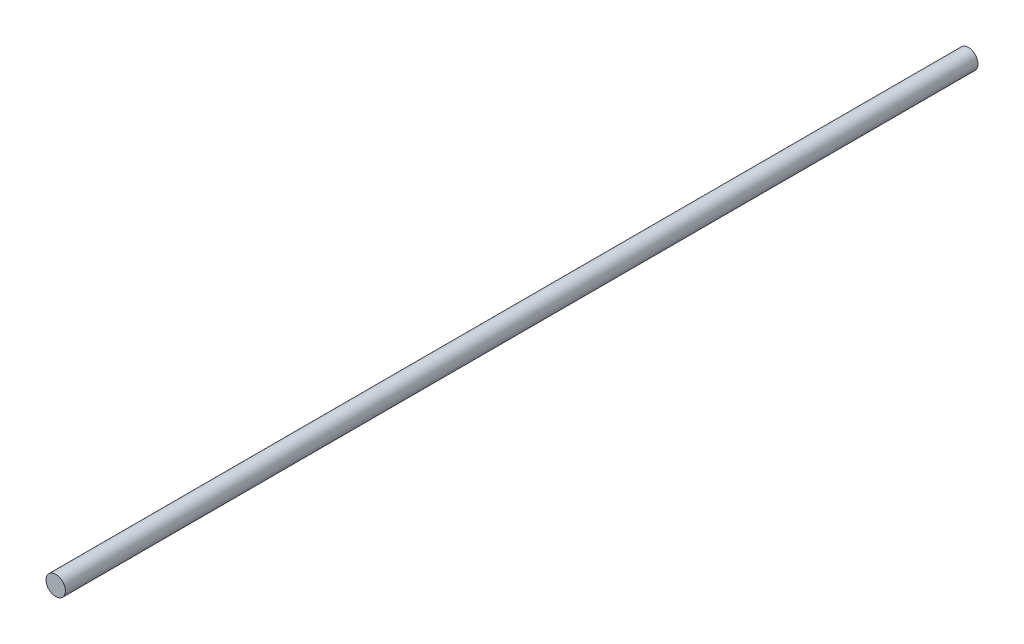
ISO-10303-21;
HEADER;
FILE_DESCRIPTION(('STEP AP214'),'2;1');
FILE_NAME('part.step','',(''),(''),'','','');
FILE_SCHEMA(('AUTOMOTIVE_DESIGN { 1 0 10303 214 1 1 1 1 }'));
ENDSEC;
DATA;
#1=APPLICATION_CONTEXT('core data for automotive mechanical design processes');
#2=APPLICATION_PROTOCOL_DEFINITION('international standard','automotive_design',2000,#1);
#3=PRODUCT_CONTEXT('',#1,'mechanical');
#4=PRODUCT('Part','Part','',(#3));
#5=PRODUCT_RELATED_PRODUCT_CATEGORY('part','',(#4));
#6=PRODUCT_DEFINITION_FORMATION('','',#4);
#7=PRODUCT_DEFINITION_CONTEXT('part definition',#1,'design');
#8=PRODUCT_DEFINITION('design','',#6,#7);
#9=PRODUCT_DEFINITION_SHAPE('','',#8);
#10=(LENGTH_UNIT() NAMED_UNIT(*) SI_UNIT(.MILLI.,.METRE.));
#11=(NAMED_UNIT(*) PLANE_ANGLE_UNIT() SI_UNIT($,.RADIAN.));
#12=(NAMED_UNIT(*) SI_UNIT($,.STERADIAN.) SOLID_ANGLE_UNIT());
#13=UNCERTAINTY_MEASURE_WITH_UNIT(LENGTH_MEASURE(1.E-05),#10,'distance_accuracy_value','');
#14=(GEOMETRIC_REPRESENTATION_CONTEXT(3) GLOBAL_UNCERTAINTY_ASSIGNED_CONTEXT((#13)) GLOBAL_UNIT_ASSIGNED_CONTEXT((#10,
#11,#12)) REPRESENTATION_CONTEXT('',''));
#15=CARTESIAN_POINT('',(0.,0.,0.));
#16=DIRECTION('',(0.,0.,1.));
#17=DIRECTION('',(1.,0.,0.));
#18=AXIS2_PLACEMENT_3D('',#15,#16,#17);
#19=CARTESIAN_POINT('',(0.,0.,161.559861243491));
#20=DIRECTION('',(0.,0.,-1.));
#21=DIRECTION('',(-1.,0.,0.));
#22=AXIS2_PLACEMENT_3D('',#19,#20,#21);
#23=CYLINDRICAL_SURFACE('',#22,3.2385);
#24=CARTESIAN_POINT('',(0.,0.,152.4));
#25=DIRECTION('',(0.,0.,-1.));
#26=DIRECTION('',(-1.,0.,0.));
#27=AXIS2_PLACEMENT_3D('',#24,#25,#26);
#28=CIRCLE('',#27,3.2385);
#29=CARTESIAN_POINT('',(-3.2385,0.,152.4));
#30=VERTEX_POINT('',#29);
#31=EDGE_CURVE('E11',#30,#30,#28,.F.);
#32=ORIENTED_EDGE('',*,*,#31,.F.);
#33=EDGE_LOOP('',(#32));
#34=FACE_BOUND('',#33,.T.);
#35=CARTESIAN_POINT('',(0.,0.,-152.4));
#36=DIRECTION('',(0.,0.,-1.));
#37=DIRECTION('',(-1.,0.,0.));
#38=AXIS2_PLACEMENT_3D('',#35,#36,#37);
#39=CIRCLE('',#38,3.2385);
#40=CARTESIAN_POINT('',(-3.2385,0.,-152.4));
#41=VERTEX_POINT('',#40);
#42=EDGE_CURVE('E46',#41,#41,#39,.T.);
#43=ORIENTED_EDGE('',*,*,#42,.F.);
#44=EDGE_LOOP('',(#43));
#45=FACE_BOUND('',#44,.T.);
#46=ADVANCED_FACE('F39',(#34,#45),#23,.T.);
#47=CARTESIAN_POINT('',(0.,3.17500000000003,-152.4));
#48=DIRECTION('',(0.,0.,1.));
#49=DIRECTION('',(1.,0.,0.));
#50=AXIS2_PLACEMENT_3D('',#47,#48,#49);
#51=PLANE('',#50);
#52=ORIENTED_EDGE('',*,*,#42,.T.);
#53=EDGE_LOOP('',(#52));
#54=FACE_BOUND('',#53,.T.);
#55=ADVANCED_FACE('F41',(#54),#51,.F.);
#56=CARTESIAN_POINT('',(0.,0.,152.4));
#57=DIRECTION('',(0.,0.,-1.));
#58=DIRECTION('',(-1.,0.,0.));
#59=AXIS2_PLACEMENT_3D('',#56,#57,#58);
#60=PLANE('',#59);
#61=ORIENTED_EDGE('',*,*,#31,.T.);
#62=EDGE_LOOP('',(#61));
#63=FACE_BOUND('',#62,.T.);
#64=ADVANCED_FACE('F59',(#63),#60,.F.);
#65=CLOSED_SHELL('',(#46,#55,#64));
#66=MANIFOLD_SOLID_BREP('B2',#65);
#67=ADVANCED_BREP_SHAPE_REPRESENTATION('',(#18,#66),#14);
#68=SHAPE_DEFINITION_REPRESENTATION(#9,#67);
ENDSEC;
END-ISO-10303-21;
